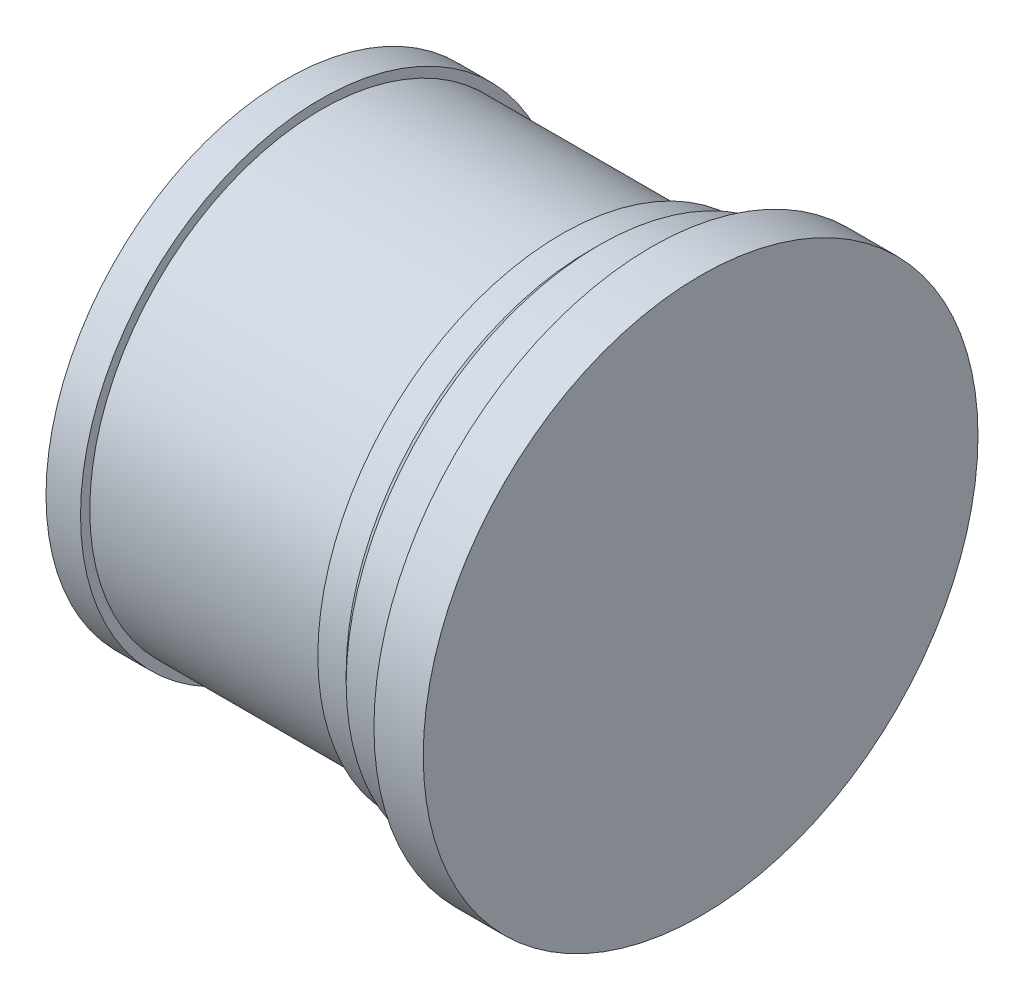
ISO-10303-21;
HEADER;
FILE_DESCRIPTION(('STEP AP214'),'2;1');
FILE_NAME('part.step','',(''),(''),'','','');
FILE_SCHEMA(('AUTOMOTIVE_DESIGN { 1 0 10303 214 1 1 1 1 }'));
ENDSEC;
DATA;
#1=APPLICATION_CONTEXT('core data for automotive mechanical design processes');
#2=APPLICATION_PROTOCOL_DEFINITION('international standard','automotive_design',2000,#1);
#3=PRODUCT_CONTEXT('',#1,'mechanical');
#4=PRODUCT('Part','Part','',(#3));
#5=PRODUCT_RELATED_PRODUCT_CATEGORY('part','',(#4));
#6=PRODUCT_DEFINITION_FORMATION('','',#4);
#7=PRODUCT_DEFINITION_CONTEXT('part definition',#1,'design');
#8=PRODUCT_DEFINITION('design','',#6,#7);
#9=PRODUCT_DEFINITION_SHAPE('','',#8);
#10=(LENGTH_UNIT() NAMED_UNIT(*) SI_UNIT(.MILLI.,.METRE.));
#11=(NAMED_UNIT(*) PLANE_ANGLE_UNIT() SI_UNIT($,.RADIAN.));
#12=(NAMED_UNIT(*) SI_UNIT($,.STERADIAN.) SOLID_ANGLE_UNIT());
#13=UNCERTAINTY_MEASURE_WITH_UNIT(LENGTH_MEASURE(1.E-05),#10,'distance_accuracy_value','');
#14=(GEOMETRIC_REPRESENTATION_CONTEXT(3) GLOBAL_UNCERTAINTY_ASSIGNED_CONTEXT((#13)) GLOBAL_UNIT_ASSIGNED_CONTEXT((#10,
#11,#12)) REPRESENTATION_CONTEXT('',''));
#15=CARTESIAN_POINT('',(0.,0.,0.));
#16=DIRECTION('',(0.,0.,1.));
#17=DIRECTION('',(1.,0.,0.));
#18=AXIS2_PLACEMENT_3D('',#15,#16,#17);
#19=CARTESIAN_POINT('',(0.,0.,0.));
#20=DIRECTION('',(1.,0.,0.));
#21=DIRECTION('',(0.,0.,-1.));
#22=AXIS2_PLACEMENT_3D('',#19,#20,#21);
#23=PLANE('',#22);
#24=CARTESIAN_POINT('',(0.,0.,0.));
#25=DIRECTION('',(-1.,0.,0.));
#26=DIRECTION('',(0.,0.,1.));
#27=AXIS2_PLACEMENT_3D('',#24,#25,#26);
#28=CIRCLE('',#27,19.5);
#29=CARTESIAN_POINT('',(0.,0.,19.5));
#30=VERTEX_POINT('',#29);
#31=EDGE_CURVE('E10',#30,#30,#28,.T.);
#32=ORIENTED_EDGE('',*,*,#31,.T.);
#33=EDGE_LOOP('',(#32));
#34=FACE_BOUND('',#33,.T.);
#35=ADVANCED_FACE('F37',(#34),#23,.F.);
#36=CARTESIAN_POINT('',(0.,0.,0.));
#37=DIRECTION('',(-1.,0.,0.));
#38=DIRECTION('',(0.,0.,1.));
#39=AXIS2_PLACEMENT_3D('',#36,#37,#38);
#40=CYLINDRICAL_SURFACE('',#39,19.5);
#41=ORIENTED_EDGE('',*,*,#31,.F.);
#42=EDGE_LOOP('',(#41));
#43=FACE_BOUND('',#42,.T.);
#44=CARTESIAN_POINT('',(2.8,0.,0.));
#45=DIRECTION('',(-1.,0.,0.));
#46=DIRECTION('',(0.,0.,1.));
#47=AXIS2_PLACEMENT_3D('',#44,#45,#46);
#48=CIRCLE('',#47,19.5);
#49=CARTESIAN_POINT('',(2.8,0.,19.5));
#50=VERTEX_POINT('',#49);
#51=EDGE_CURVE('E44',#50,#50,#48,.T.);
#52=ORIENTED_EDGE('',*,*,#51,.T.);
#53=EDGE_LOOP('',(#52));
#54=FACE_BOUND('',#53,.T.);
#55=ADVANCED_FACE('F105',(#43,#54),#40,.T.);
#56=CARTESIAN_POINT('',(2.8,19.5,0.));
#57=DIRECTION('',(-1.,0.,0.));
#58=DIRECTION('',(0.,0.,1.));
#59=AXIS2_PLACEMENT_3D('',#56,#57,#58);
#60=PLANE('',#59);
#61=ORIENTED_EDGE('',*,*,#51,.F.);
#62=EDGE_LOOP('',(#61));
#63=FACE_BOUND('',#62,.T.);
#64=CARTESIAN_POINT('',(2.8,0.,0.));
#65=DIRECTION('',(-1.,0.,0.));
#66=DIRECTION('',(0.,0.,1.));
#67=AXIS2_PLACEMENT_3D('',#64,#65,#66);
#68=CIRCLE('',#67,18.75);
#69=CARTESIAN_POINT('',(2.8,0.,18.75));
#70=VERTEX_POINT('',#69);
#71=EDGE_CURVE('E49',#70,#70,#68,.T.);
#72=ORIENTED_EDGE('',*,*,#71,.T.);
#73=EDGE_LOOP('',(#72));
#74=FACE_BOUND('',#73,.T.);
#75=ADVANCED_FACE('F109',(#63,#74),#60,.F.);
#76=CARTESIAN_POINT('',(0.,0.,0.));
#77=DIRECTION('',(-1.,0.,0.));
#78=DIRECTION('',(0.,0.,1.));
#79=AXIS2_PLACEMENT_3D('',#76,#77,#78);
#80=CYLINDRICAL_SURFACE('',#79,18.75);
#81=ORIENTED_EDGE('',*,*,#71,.F.);
#82=EDGE_LOOP('',(#81));
#83=FACE_BOUND('',#82,.T.);
#84=CARTESIAN_POINT('',(22.3,0.,0.));
#85=DIRECTION('',(-1.,0.,0.));
#86=DIRECTION('',(0.,0.,1.));
#87=AXIS2_PLACEMENT_3D('',#84,#85,#86);
#88=CIRCLE('',#87,18.75);
#89=CARTESIAN_POINT('',(22.3,0.,18.75));
#90=VERTEX_POINT('',#89);
#91=EDGE_CURVE('E54',#90,#90,#88,.T.);
#92=ORIENTED_EDGE('',*,*,#91,.T.);
#93=EDGE_LOOP('',(#92));
#94=FACE_BOUND('',#93,.T.);
#95=ADVANCED_FACE('F114',(#83,#94),#80,.T.);
#96=CARTESIAN_POINT('',(22.3,18.75,0.));
#97=DIRECTION('',(1.,0.,0.));
#98=DIRECTION('',(0.,0.,-1.));
#99=AXIS2_PLACEMENT_3D('',#96,#97,#98);
#100=PLANE('',#99);
#101=ORIENTED_EDGE('',*,*,#91,.F.);
#102=EDGE_LOOP('',(#101));
#103=FACE_BOUND('',#102,.T.);
#104=CARTESIAN_POINT('',(22.3,0.,0.));
#105=DIRECTION('',(-1.,0.,0.));
#106=DIRECTION('',(0.,0.,1.));
#107=AXIS2_PLACEMENT_3D('',#104,#105,#106);
#108=CIRCLE('',#107,19.75);
#109=CARTESIAN_POINT('',(22.3,0.,19.75));
#110=VERTEX_POINT('',#109);
#111=EDGE_CURVE('E60',#110,#110,#108,.T.);
#112=ORIENTED_EDGE('',*,*,#111,.T.);
#113=EDGE_LOOP('',(#112));
#114=FACE_BOUND('',#113,.T.);
#115=ADVANCED_FACE('F120',(#103,#114),#100,.F.);
#116=CARTESIAN_POINT('',(0.,0.,0.));
#117=DIRECTION('',(-1.,0.,0.));
#118=DIRECTION('',(0.,0.,1.));
#119=AXIS2_PLACEMENT_3D('',#116,#117,#118);
#120=CYLINDRICAL_SURFACE('',#119,19.75);
#121=ORIENTED_EDGE('',*,*,#111,.F.);
#122=EDGE_LOOP('',(#121));
#123=FACE_BOUND('',#122,.T.);
#124=CARTESIAN_POINT('',(24.6,0.,0.));
#125=DIRECTION('',(-1.,0.,0.));
#126=DIRECTION('',(0.,0.,1.));
#127=AXIS2_PLACEMENT_3D('',#124,#125,#126);
#128=CIRCLE('',#127,19.75);
#129=CARTESIAN_POINT('',(24.6,0.,19.75));
#130=VERTEX_POINT('',#129);
#131=EDGE_CURVE('E64',#130,#130,#128,.T.);
#132=ORIENTED_EDGE('',*,*,#131,.T.);
#133=EDGE_LOOP('',(#132));
#134=FACE_BOUND('',#133,.T.);
#135=ADVANCED_FACE('F124',(#123,#134),#120,.T.);
#136=CARTESIAN_POINT('',(25.35,0.,0.));
#137=DIRECTION('',(1.,0.,0.));
#138=DIRECTION('',(0.,0.,-1.));
#139=AXIS2_PLACEMENT_3D('',#136,#137,#138);
#140=CONICAL_SURFACE('',#139,20.5,0.785398163397448);
#141=ORIENTED_EDGE('',*,*,#131,.F.);
#142=EDGE_LOOP('',(#141));
#143=FACE_BOUND('',#142,.T.);
#144=CARTESIAN_POINT('',(25.35,0.,0.));
#145=DIRECTION('',(-1.,0.,0.));
#146=DIRECTION('',(0.,0.,1.));
#147=AXIS2_PLACEMENT_3D('',#144,#145,#146);
#148=CIRCLE('',#147,20.5);
#149=CARTESIAN_POINT('',(25.35,0.,20.5));
#150=VERTEX_POINT('',#149);
#151=EDGE_CURVE('E68',#150,#150,#148,.T.);
#152=ORIENTED_EDGE('',*,*,#151,.T.);
#153=EDGE_LOOP('',(#152));
#154=FACE_BOUND('',#153,.T.);
#155=ADVANCED_FACE('F128',(#143,#154),#140,.T.);
#156=CARTESIAN_POINT('',(0.,0.,0.));
#157=DIRECTION('',(-1.,0.,0.));
#158=DIRECTION('',(0.,0.,1.));
#159=AXIS2_PLACEMENT_3D('',#156,#157,#158);
#160=CYLINDRICAL_SURFACE('',#159,20.5);
#161=ORIENTED_EDGE('',*,*,#151,.F.);
#162=EDGE_LOOP('',(#161));
#163=FACE_BOUND('',#162,.T.);
#164=CARTESIAN_POINT('',(28.85,0.,0.));
#165=DIRECTION('',(-1.,0.,0.));
#166=DIRECTION('',(0.,0.,1.));
#167=AXIS2_PLACEMENT_3D('',#164,#165,#166);
#168=CIRCLE('',#167,20.5);
#169=CARTESIAN_POINT('',(28.85,0.,20.5));
#170=VERTEX_POINT('',#169);
#171=EDGE_CURVE('E72',#170,#170,#168,.T.);
#172=ORIENTED_EDGE('',*,*,#171,.T.);
#173=EDGE_LOOP('',(#172));
#174=FACE_BOUND('',#173,.T.);
#175=ADVANCED_FACE('F132',(#163,#174),#160,.T.);
#176=CARTESIAN_POINT('',(28.85,20.5,0.));
#177=DIRECTION('',(-1.,0.,0.));
#178=DIRECTION('',(0.,0.,1.));
#179=AXIS2_PLACEMENT_3D('',#176,#177,#178);
#180=PLANE('',#179);
#181=ORIENTED_EDGE('',*,*,#171,.F.);
#182=EDGE_LOOP('',(#181));
#183=FACE_BOUND('',#182,.T.);
#184=CARTESIAN_POINT('',(28.85,0.,0.));
#185=DIRECTION('',(-1.,0.,0.));
#186=DIRECTION('',(0.,0.,1.));
#187=AXIS2_PLACEMENT_3D('',#184,#185,#186);
#188=CIRCLE('',#187,19.75);
#189=CARTESIAN_POINT('',(28.85,0.,19.75));
#190=VERTEX_POINT('',#189);
#191=EDGE_CURVE('E76',#190,#190,#188,.T.);
#192=ORIENTED_EDGE('',*,*,#191,.T.);
#193=EDGE_LOOP('',(#192));
#194=FACE_BOUND('',#193,.T.);
#195=ADVANCED_FACE('F136',(#183,#194),#180,.F.);
#196=CARTESIAN_POINT('',(0.,0.,0.));
#197=DIRECTION('',(-1.,0.,0.));
#198=DIRECTION('',(0.,0.,1.));
#199=AXIS2_PLACEMENT_3D('',#196,#197,#198);
#200=CYLINDRICAL_SURFACE('',#199,19.75);
#201=ORIENTED_EDGE('',*,*,#191,.F.);
#202=EDGE_LOOP('',(#201));
#203=FACE_BOUND('',#202,.T.);
#204=CARTESIAN_POINT('',(29.6,0.,0.));
#205=DIRECTION('',(-1.,0.,0.));
#206=DIRECTION('',(0.,0.,1.));
#207=AXIS2_PLACEMENT_3D('',#204,#205,#206);
#208=CIRCLE('',#207,19.75);
#209=CARTESIAN_POINT('',(29.6,0.,19.75));
#210=VERTEX_POINT('',#209);
#211=EDGE_CURVE('E80',#210,#210,#208,.T.);
#212=ORIENTED_EDGE('',*,*,#211,.T.);
#213=EDGE_LOOP('',(#212));
#214=FACE_BOUND('',#213,.T.);
#215=ADVANCED_FACE('F140',(#203,#214),#200,.T.);
#216=CARTESIAN_POINT('',(29.6,19.75,0.));
#217=DIRECTION('',(1.,0.,0.));
#218=DIRECTION('',(0.,0.,-1.));
#219=AXIS2_PLACEMENT_3D('',#216,#217,#218);
#220=PLANE('',#219);
#221=ORIENTED_EDGE('',*,*,#211,.F.);
#222=EDGE_LOOP('',(#221));
#223=FACE_BOUND('',#222,.T.);
#224=CARTESIAN_POINT('',(29.6,0.,0.));
#225=DIRECTION('',(-1.,0.,0.));
#226=DIRECTION('',(0.,0.,1.));
#227=AXIS2_PLACEMENT_3D('',#224,#225,#226);
#228=CIRCLE('',#227,22.5);
#229=CARTESIAN_POINT('',(29.6,0.,22.5));
#230=VERTEX_POINT('',#229);
#231=EDGE_CURVE('E84',#230,#230,#228,.T.);
#232=ORIENTED_EDGE('',*,*,#231,.T.);
#233=EDGE_LOOP('',(#232));
#234=FACE_BOUND('',#233,.T.);
#235=ADVANCED_FACE('F101',(#223,#234),#220,.F.);
#236=CARTESIAN_POINT('',(0.,0.,0.));
#237=DIRECTION('',(-1.,0.,0.));
#238=DIRECTION('',(0.,0.,1.));
#239=AXIS2_PLACEMENT_3D('',#236,#237,#238);
#240=CYLINDRICAL_SURFACE('',#239,22.5);
#241=ORIENTED_EDGE('',*,*,#231,.F.);
#242=EDGE_LOOP('',(#241));
#243=FACE_BOUND('',#242,.T.);
#244=CARTESIAN_POINT('',(33.6,0.,0.));
#245=DIRECTION('',(-1.,0.,0.));
#246=DIRECTION('',(0.,0.,1.));
#247=AXIS2_PLACEMENT_3D('',#244,#245,#246);
#248=CIRCLE('',#247,22.5);
#249=CARTESIAN_POINT('',(33.6,0.,22.5));
#250=VERTEX_POINT('',#249);
#251=EDGE_CURVE('E88',#250,#250,#248,.T.);
#252=ORIENTED_EDGE('',*,*,#251,.T.);
#253=EDGE_LOOP('',(#252));
#254=FACE_BOUND('',#253,.T.);
#255=ADVANCED_FACE('F93',(#243,#254),#240,.T.);
#256=CARTESIAN_POINT('',(33.6,22.5,0.));
#257=DIRECTION('',(-1.,0.,0.));
#258=DIRECTION('',(0.,0.,1.));
#259=AXIS2_PLACEMENT_3D('',#256,#257,#258);
#260=PLANE('',#259);
#261=ORIENTED_EDGE('',*,*,#251,.F.);
#262=EDGE_LOOP('',(#261));
#263=FACE_BOUND('',#262,.T.);
#264=ADVANCED_FACE('F95',(#263),#260,.F.);
#265=CLOSED_SHELL('',(#35,#55,#75,#95,#115,#135,#155,#175,#195,#215,#235,#255,#264));
#266=MANIFOLD_SOLID_BREP('B2',#265);
#267=ADVANCED_BREP_SHAPE_REPRESENTATION('',(#18,#266),#14);
#268=SHAPE_DEFINITION_REPRESENTATION(#9,#267);
ENDSEC;
END-ISO-10303-21;
